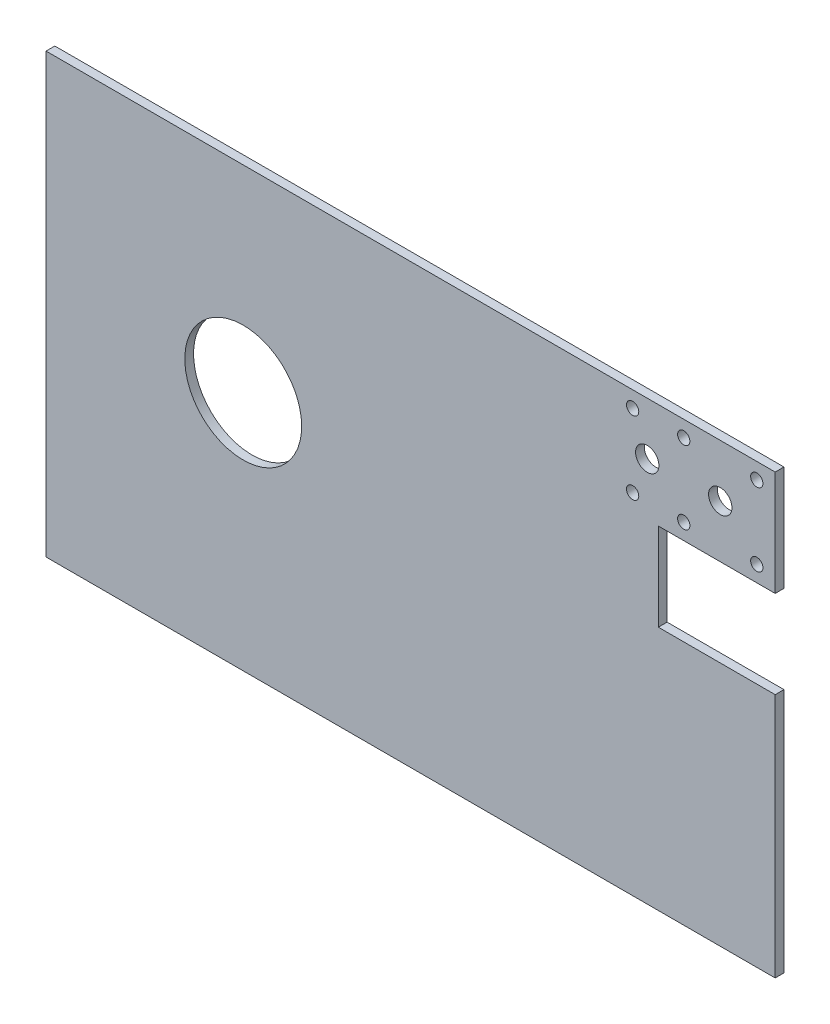
ISO-10303-21;
HEADER;
FILE_DESCRIPTION(('STEP AP214'),'2;1');
FILE_NAME('part.step','',(''),(''),'','','');
FILE_SCHEMA(('AUTOMOTIVE_DESIGN { 1 0 10303 214 1 1 1 1 }'));
ENDSEC;
DATA;
#1=APPLICATION_CONTEXT('core data for automotive mechanical design processes');
#2=APPLICATION_PROTOCOL_DEFINITION('international standard','automotive_design',2000,#1);
#3=PRODUCT_CONTEXT('',#1,'mechanical');
#4=PRODUCT('Part','Part','',(#3));
#5=PRODUCT_RELATED_PRODUCT_CATEGORY('part','',(#4));
#6=PRODUCT_DEFINITION_FORMATION('','',#4);
#7=PRODUCT_DEFINITION_CONTEXT('part definition',#1,'design');
#8=PRODUCT_DEFINITION('design','',#6,#7);
#9=PRODUCT_DEFINITION_SHAPE('','',#8);
#10=(LENGTH_UNIT() NAMED_UNIT(*) SI_UNIT(.MILLI.,.METRE.));
#11=(NAMED_UNIT(*) PLANE_ANGLE_UNIT() SI_UNIT($,.RADIAN.));
#12=(NAMED_UNIT(*) SI_UNIT($,.STERADIAN.) SOLID_ANGLE_UNIT());
#13=UNCERTAINTY_MEASURE_WITH_UNIT(LENGTH_MEASURE(1.E-05),#10,'distance_accuracy_value','');
#14=(GEOMETRIC_REPRESENTATION_CONTEXT(3) GLOBAL_UNCERTAINTY_ASSIGNED_CONTEXT((#13)) GLOBAL_UNIT_ASSIGNED_CONTEXT((#10,
#11,#12)) REPRESENTATION_CONTEXT('',''));
#15=CARTESIAN_POINT('',(0.,0.,0.));
#16=DIRECTION('',(0.,0.,1.));
#17=DIRECTION('',(1.,0.,0.));
#18=AXIS2_PLACEMENT_3D('',#15,#16,#17);
#19=CARTESIAN_POINT('',(249.6,0.,3.));
#20=DIRECTION('',(-1.,0.,0.));
#21=DIRECTION('',(0.,-1.,0.));
#22=AXIS2_PLACEMENT_3D('',#19,#20,#21);
#23=PLANE('',#22);
#24=DIRECTION('',(0.,1.,0.));
#25=VECTOR('',#24,1.);
#26=CARTESIAN_POINT('',(249.6,0.,3.));
#27=LINE('',#26,#25);
#28=CARTESIAN_POINT('',(249.6,-35.9999999999997,3.));
#29=VERTEX_POINT('',#28);
#30=CARTESIAN_POINT('',(249.6,0.,3.));
#31=VERTEX_POINT('',#30);
#32=EDGE_CURVE('E147',#29,#31,#27,.T.);
#33=ORIENTED_EDGE('',*,*,#32,.F.);
#34=DIRECTION('',(0.,0.,1.));
#35=VECTOR('',#34,1.);
#36=CARTESIAN_POINT('',(249.6,-35.9999999999997,-2.));
#37=LINE('',#36,#35);
#38=CARTESIAN_POINT('',(249.6,-35.9999999999997,0.));
#39=VERTEX_POINT('',#38);
#40=EDGE_CURVE('E135',#39,#29,#37,.T.);
#41=ORIENTED_EDGE('',*,*,#40,.F.);
#42=DIRECTION('',(0.,1.,0.));
#43=VECTOR('',#42,1.);
#44=CARTESIAN_POINT('',(249.6,0.,0.));
#45=LINE('',#44,#43);
#46=CARTESIAN_POINT('',(249.6,0.,0.));
#47=VERTEX_POINT('',#46);
#48=EDGE_CURVE('E155',#39,#47,#45,.T.);
#49=ORIENTED_EDGE('',*,*,#48,.T.);
#50=DIRECTION('',(0.,0.,-1.));
#51=VECTOR('',#50,1.);
#52=CARTESIAN_POINT('',(249.6,0.,3.));
#53=LINE('',#52,#51);
#54=EDGE_CURVE('E161',#31,#47,#53,.T.);
#55=ORIENTED_EDGE('',*,*,#54,.F.);
#56=EDGE_LOOP('',(#33,#41,#49,#55));
#57=FACE_BOUND('',#56,.T.);
#58=ADVANCED_FACE('F32',(#57),#23,.F.);
#59=CARTESIAN_POINT('',(0.,0.,3.));
#60=DIRECTION('',(1.,0.,0.));
#61=DIRECTION('',(0.,0.,-1.));
#62=AXIS2_PLACEMENT_3D('',#59,#60,#61);
#63=PLANE('',#62);
#64=DIRECTION('',(0.,-1.,0.));
#65=VECTOR('',#64,1.);
#66=CARTESIAN_POINT('',(0.,0.,0.));
#67=LINE('',#66,#65);
#68=CARTESIAN_POINT('',(0.,0.,0.));
#69=VERTEX_POINT('',#68);
#70=CARTESIAN_POINT('',(0.,-150.,0.));
#71=VERTEX_POINT('',#70);
#72=EDGE_CURVE('E141',#69,#71,#67,.T.);
#73=ORIENTED_EDGE('',*,*,#72,.T.);
#74=DIRECTION('',(0.,0.,-1.));
#75=VECTOR('',#74,1.);
#76=CARTESIAN_POINT('',(0.,-150.,3.));
#77=LINE('',#76,#75);
#78=CARTESIAN_POINT('',(0.,-150.,3.));
#79=VERTEX_POINT('',#78);
#80=EDGE_CURVE('E166',#79,#71,#77,.T.);
#81=ORIENTED_EDGE('',*,*,#80,.F.);
#82=DIRECTION('',(0.,-1.,0.));
#83=VECTOR('',#82,1.);
#84=CARTESIAN_POINT('',(0.,0.,3.));
#85=LINE('',#84,#83);
#86=CARTESIAN_POINT('',(0.,0.,3.));
#87=VERTEX_POINT('',#86);
#88=EDGE_CURVE('E144',#87,#79,#85,.T.);
#89=ORIENTED_EDGE('',*,*,#88,.F.);
#90=DIRECTION('',(0.,0.,-1.));
#91=VECTOR('',#90,1.);
#92=CARTESIAN_POINT('',(0.,0.,3.));
#93=LINE('',#92,#91);
#94=EDGE_CURVE('E150',#87,#69,#93,.T.);
#95=ORIENTED_EDGE('',*,*,#94,.T.);
#96=EDGE_LOOP('',(#73,#81,#89,#95));
#97=FACE_BOUND('',#96,.T.);
#98=ADVANCED_FACE('F34',(#97),#63,.F.);
#99=CARTESIAN_POINT('',(0.,-150.,3.));
#100=DIRECTION('',(0.,1.,0.));
#101=DIRECTION('',(0.,0.,1.));
#102=AXIS2_PLACEMENT_3D('',#99,#100,#101);
#103=PLANE('',#102);
#104=DIRECTION('',(1.,0.,0.));
#105=VECTOR('',#104,1.);
#106=CARTESIAN_POINT('',(0.,-150.,0.));
#107=LINE('',#106,#105);
#108=CARTESIAN_POINT('',(249.6,-150.,0.));
#109=VERTEX_POINT('',#108);
#110=EDGE_CURVE('E153',#71,#109,#107,.T.);
#111=ORIENTED_EDGE('',*,*,#110,.T.);
#112=DIRECTION('',(0.,0.,-1.));
#113=VECTOR('',#112,1.);
#114=CARTESIAN_POINT('',(249.6,-150.,3.));
#115=LINE('',#114,#113);
#116=CARTESIAN_POINT('',(249.6,-150.,3.));
#117=VERTEX_POINT('',#116);
#118=EDGE_CURVE('E163',#117,#109,#115,.T.);
#119=ORIENTED_EDGE('',*,*,#118,.F.);
#120=DIRECTION('',(1.,0.,0.));
#121=VECTOR('',#120,1.);
#122=CARTESIAN_POINT('',(0.,-150.,3.));
#123=LINE('',#122,#121);
#124=EDGE_CURVE('E85',#79,#117,#123,.T.);
#125=ORIENTED_EDGE('',*,*,#124,.F.);
#126=ORIENTED_EDGE('',*,*,#80,.T.);
#127=EDGE_LOOP('',(#111,#119,#125,#126));
#128=FACE_BOUND('',#127,.T.);
#129=ADVANCED_FACE('F183',(#128),#103,.F.);
#130=CARTESIAN_POINT('',(249.6,-65.9999999999997,0.));
#131=VERTEX_POINT('',#130);
#132=EDGE_CURVE('E156',#109,#131,#45,.T.);
#133=ORIENTED_EDGE('',*,*,#132,.T.);
#134=DIRECTION('',(0.,0.,1.));
#135=VECTOR('',#134,1.);
#136=CARTESIAN_POINT('',(249.6,-65.9999999999997,-2.));
#137=LINE('',#136,#135);
#138=CARTESIAN_POINT('',(249.6,-65.9999999999997,3.));
#139=VERTEX_POINT('',#138);
#140=EDGE_CURVE('E47',#131,#139,#137,.T.);
#141=ORIENTED_EDGE('',*,*,#140,.T.);
#142=EDGE_CURVE('E128',#117,#139,#27,.T.);
#143=ORIENTED_EDGE('',*,*,#142,.F.);
#144=ORIENTED_EDGE('',*,*,#118,.T.);
#145=EDGE_LOOP('',(#133,#141,#143,#144));
#146=FACE_BOUND('',#145,.T.);
#147=ADVANCED_FACE('F185',(#146),#23,.F.);
#148=CARTESIAN_POINT('',(0.,0.,3.));
#149=DIRECTION('',(0.,-1.,0.));
#150=DIRECTION('',(0.,0.,-1.));
#151=AXIS2_PLACEMENT_3D('',#148,#149,#150);
#152=PLANE('',#151);
#153=DIRECTION('',(-1.,0.,0.));
#154=VECTOR('',#153,1.);
#155=CARTESIAN_POINT('',(0.,0.,0.));
#156=LINE('',#155,#154);
#157=EDGE_CURVE('E77',#47,#69,#156,.T.);
#158=ORIENTED_EDGE('',*,*,#157,.T.);
#159=ORIENTED_EDGE('',*,*,#94,.F.);
#160=DIRECTION('',(-1.,0.,0.));
#161=VECTOR('',#160,1.);
#162=CARTESIAN_POINT('',(0.,0.,3.));
#163=LINE('',#162,#161);
#164=EDGE_CURVE('E56',#31,#87,#163,.T.);
#165=ORIENTED_EDGE('',*,*,#164,.F.);
#166=ORIENTED_EDGE('',*,*,#54,.T.);
#167=EDGE_LOOP('',(#158,#159,#165,#166));
#168=FACE_BOUND('',#167,.T.);
#169=ADVANCED_FACE('F178',(#168),#152,.F.);
#170=CARTESIAN_POINT('',(0.,0.,3.));
#171=DIRECTION('',(0.,0.,1.));
#172=DIRECTION('',(1.,0.,0.));
#173=AXIS2_PLACEMENT_3D('',#170,#171,#172);
#174=PLANE('',#173);
#175=CARTESIAN_POINT('',(230.799999999998,-17.9999999999998,3.));
#176=DIRECTION('',(0.,0.,1.));
#177=DIRECTION('',(1.,0.,0.));
#178=AXIS2_PLACEMENT_3D('',#175,#176,#177);
#179=CIRCLE('',#178,4.00000000000519);
#180=CARTESIAN_POINT('',(234.800000000003,-17.9999999999998,3.));
#181=VERTEX_POINT('',#180);
#182=EDGE_CURVE('E353',#181,#181,#179,.T.);
#183=ORIENTED_EDGE('',*,*,#182,.F.);
#184=EDGE_LOOP('',(#183));
#185=FACE_BOUND('',#184,.T.);
#186=CARTESIAN_POINT('',(243.299999999998,-30.4999999999998,3.));
#187=DIRECTION('',(0.,0.,1.));
#188=DIRECTION('',(1.,0.,0.));
#189=AXIS2_PLACEMENT_3D('',#186,#187,#188);
#190=CIRCLE('',#189,2.10000000000519);
#191=CARTESIAN_POINT('',(245.400000000003,-30.4999999999998,3.));
#192=VERTEX_POINT('',#191);
#193=EDGE_CURVE('E355',#192,#192,#190,.T.);
#194=ORIENTED_EDGE('',*,*,#193,.F.);
#195=EDGE_LOOP('',(#194));
#196=FACE_BOUND('',#195,.T.);
#197=CARTESIAN_POINT('',(243.299999999998,-5.49999999999979,3.));
#198=DIRECTION('',(0.,0.,1.));
#199=DIRECTION('',(1.,0.,0.));
#200=AXIS2_PLACEMENT_3D('',#197,#198,#199);
#201=CIRCLE('',#200,2.10000000000522);
#202=CARTESIAN_POINT('',(245.400000000003,-5.49999999999979,3.));
#203=VERTEX_POINT('',#202);
#204=EDGE_CURVE('E394',#203,#203,#201,.T.);
#205=ORIENTED_EDGE('',*,*,#204,.F.);
#206=EDGE_LOOP('',(#205));
#207=FACE_BOUND('',#206,.T.);
#208=CARTESIAN_POINT('',(218.299999999998,-30.4999999999998,3.));
#209=DIRECTION('',(0.,0.,1.));
#210=DIRECTION('',(1.,0.,0.));
#211=AXIS2_PLACEMENT_3D('',#208,#209,#210);
#212=CIRCLE('',#211,2.10000000000522);
#213=CARTESIAN_POINT('',(220.400000000003,-30.4999999999998,3.));
#214=VERTEX_POINT('',#213);
#215=EDGE_CURVE('E388',#214,#214,#212,.T.);
#216=ORIENTED_EDGE('',*,*,#215,.F.);
#217=EDGE_LOOP('',(#216));
#218=FACE_BOUND('',#217,.T.);
#219=CARTESIAN_POINT('',(200.799999999998,-30.4999999999997,3.));
#220=DIRECTION('',(0.,0.,1.));
#221=DIRECTION('',(1.,0.,0.));
#222=AXIS2_PLACEMENT_3D('',#219,#220,#221);
#223=CIRCLE('',#222,2.10000000000519);
#224=CARTESIAN_POINT('',(202.900000000003,-30.4999999999997,3.));
#225=VERTEX_POINT('',#224);
#226=EDGE_CURVE('E382',#225,#225,#223,.T.);
#227=ORIENTED_EDGE('',*,*,#226,.F.);
#228=EDGE_LOOP('',(#227));
#229=FACE_BOUND('',#228,.T.);
#230=CARTESIAN_POINT('',(205.799999999996,-18.0000000000112,3.));
#231=DIRECTION('',(0.,0.,1.));
#232=DIRECTION('',(1.,0.,0.));
#233=AXIS2_PLACEMENT_3D('',#230,#231,#232);
#234=CIRCLE('',#233,4.00000000000583);
#235=CARTESIAN_POINT('',(209.800000000001,-18.0000000000112,3.));
#236=VERTEX_POINT('',#235);
#237=EDGE_CURVE('E376',#236,#236,#234,.T.);
#238=ORIENTED_EDGE('',*,*,#237,.F.);
#239=EDGE_LOOP('',(#238));
#240=FACE_BOUND('',#239,.T.);
#241=CARTESIAN_POINT('',(218.299999999998,-5.49999999999974,3.));
#242=DIRECTION('',(0.,0.,1.));
#243=DIRECTION('',(1.,0.,0.));
#244=AXIS2_PLACEMENT_3D('',#241,#242,#243);
#245=CIRCLE('',#244,2.10000000000522);
#246=CARTESIAN_POINT('',(220.400000000003,-5.49999999999974,3.));
#247=VERTEX_POINT('',#246);
#248=EDGE_CURVE('E366',#247,#247,#245,.T.);
#249=ORIENTED_EDGE('',*,*,#248,.F.);
#250=EDGE_LOOP('',(#249));
#251=FACE_BOUND('',#250,.T.);
#252=CARTESIAN_POINT('',(200.799999999998,-5.49999999999971,3.));
#253=DIRECTION('',(0.,0.,1.));
#254=DIRECTION('',(1.,0.,0.));
#255=AXIS2_PLACEMENT_3D('',#252,#253,#254);
#256=CIRCLE('',#255,2.10000000000519);
#257=CARTESIAN_POINT('',(202.900000000003,-5.49999999999971,3.));
#258=VERTEX_POINT('',#257);
#259=EDGE_CURVE('E360',#258,#258,#256,.T.);
#260=ORIENTED_EDGE('',*,*,#259,.F.);
#261=EDGE_LOOP('',(#260));
#262=FACE_BOUND('',#261,.T.);
#263=DIRECTION('',(-1.,0.,0.));
#264=VECTOR('',#263,1.);
#265=CARTESIAN_POINT('',(209.6,-35.9999999999997,3.));
#266=LINE('',#265,#264);
#267=CARTESIAN_POINT('',(209.6,-35.9999999999997,3.));
#268=VERTEX_POINT('',#267);
#269=EDGE_CURVE('E113',#29,#268,#266,.T.);
#270=ORIENTED_EDGE('',*,*,#269,.F.);
#271=ORIENTED_EDGE('',*,*,#32,.T.);
#272=ORIENTED_EDGE('',*,*,#164,.T.);
#273=ORIENTED_EDGE('',*,*,#88,.T.);
#274=ORIENTED_EDGE('',*,*,#124,.T.);
#275=ORIENTED_EDGE('',*,*,#142,.T.);
#276=DIRECTION('',(1.,0.,0.));
#277=VECTOR('',#276,1.);
#278=CARTESIAN_POINT('',(209.6,-65.9999999999997,3.));
#279=LINE('',#278,#277);
#280=CARTESIAN_POINT('',(209.6,-65.9999999999997,3.));
#281=VERTEX_POINT('',#280);
#282=EDGE_CURVE('E109',#281,#139,#279,.T.);
#283=ORIENTED_EDGE('',*,*,#282,.F.);
#284=DIRECTION('',(0.,-1.,0.));
#285=VECTOR('',#284,1.);
#286=CARTESIAN_POINT('',(209.6,-35.9999999999997,3.));
#287=LINE('',#286,#285);
#288=EDGE_CURVE('E116',#268,#281,#287,.T.);
#289=ORIENTED_EDGE('',*,*,#288,.F.);
#290=EDGE_LOOP('',(#270,#271,#272,#273,#274,#275,#283,#289));
#291=FACE_BOUND('',#290,.T.);
#292=CARTESIAN_POINT('',(67.5000000000002,-67.5000000000002,3.));
#293=DIRECTION('',(0.,0.,1.));
#294=DIRECTION('',(1.,0.,0.));
#295=AXIS2_PLACEMENT_3D('',#292,#293,#294);
#296=CIRCLE('',#295,20.);
#297=CARTESIAN_POINT('',(87.5000000000002,-67.5000000000002,3.));
#298=VERTEX_POINT('',#297);
#299=EDGE_CURVE('E134',#298,#298,#296,.T.);
#300=ORIENTED_EDGE('',*,*,#299,.F.);
#301=EDGE_LOOP('',(#300));
#302=FACE_BOUND('',#301,.T.);
#303=ADVANCED_FACE('F125',(#185,#196,#207,#218,#229,#240,#251,#262,#291,#302),#174,.T.);
#304=CARTESIAN_POINT('',(0.,0.,0.));
#305=DIRECTION('',(0.,0.,1.));
#306=DIRECTION('',(1.,0.,0.));
#307=AXIS2_PLACEMENT_3D('',#304,#305,#306);
#308=PLANE('',#307);
#309=CARTESIAN_POINT('',(230.799999999998,-17.9999999999998,0.));
#310=DIRECTION('',(0.,0.,1.));
#311=DIRECTION('',(1.,0.,0.));
#312=AXIS2_PLACEMENT_3D('',#309,#310,#311);
#313=CIRCLE('',#312,4.00000000000519);
#314=CARTESIAN_POINT('',(234.800000000003,-17.9999999999998,0.));
#315=VERTEX_POINT('',#314);
#316=EDGE_CURVE('E350',#315,#315,#313,.T.);
#317=ORIENTED_EDGE('',*,*,#316,.T.);
#318=EDGE_LOOP('',(#317));
#319=FACE_BOUND('',#318,.T.);
#320=CARTESIAN_POINT('',(243.299999999998,-30.4999999999998,0.));
#321=DIRECTION('',(0.,0.,1.));
#322=DIRECTION('',(1.,0.,0.));
#323=AXIS2_PLACEMENT_3D('',#320,#321,#322);
#324=CIRCLE('',#323,2.10000000000519);
#325=CARTESIAN_POINT('',(245.400000000003,-30.4999999999998,0.));
#326=VERTEX_POINT('',#325);
#327=EDGE_CURVE('E397',#326,#326,#324,.T.);
#328=ORIENTED_EDGE('',*,*,#327,.T.);
#329=EDGE_LOOP('',(#328));
#330=FACE_BOUND('',#329,.T.);
#331=CARTESIAN_POINT('',(243.299999999998,-5.49999999999979,0.));
#332=DIRECTION('',(0.,0.,1.));
#333=DIRECTION('',(1.,0.,0.));
#334=AXIS2_PLACEMENT_3D('',#331,#332,#333);
#335=CIRCLE('',#334,2.10000000000522);
#336=CARTESIAN_POINT('',(245.400000000003,-5.49999999999979,0.));
#337=VERTEX_POINT('',#336);
#338=EDGE_CURVE('E391',#337,#337,#335,.T.);
#339=ORIENTED_EDGE('',*,*,#338,.T.);
#340=EDGE_LOOP('',(#339));
#341=FACE_BOUND('',#340,.T.);
#342=CARTESIAN_POINT('',(218.299999999998,-30.4999999999998,0.));
#343=DIRECTION('',(0.,0.,1.));
#344=DIRECTION('',(1.,0.,0.));
#345=AXIS2_PLACEMENT_3D('',#342,#343,#344);
#346=CIRCLE('',#345,2.10000000000522);
#347=CARTESIAN_POINT('',(220.400000000003,-30.4999999999998,0.));
#348=VERTEX_POINT('',#347);
#349=EDGE_CURVE('E385',#348,#348,#346,.T.);
#350=ORIENTED_EDGE('',*,*,#349,.T.);
#351=EDGE_LOOP('',(#350));
#352=FACE_BOUND('',#351,.T.);
#353=CARTESIAN_POINT('',(200.799999999998,-30.4999999999997,0.));
#354=DIRECTION('',(0.,0.,1.));
#355=DIRECTION('',(1.,0.,0.));
#356=AXIS2_PLACEMENT_3D('',#353,#354,#355);
#357=CIRCLE('',#356,2.10000000000519);
#358=CARTESIAN_POINT('',(202.900000000003,-30.4999999999997,0.));
#359=VERTEX_POINT('',#358);
#360=EDGE_CURVE('E379',#359,#359,#357,.T.);
#361=ORIENTED_EDGE('',*,*,#360,.T.);
#362=EDGE_LOOP('',(#361));
#363=FACE_BOUND('',#362,.T.);
#364=CARTESIAN_POINT('',(205.799999999996,-18.0000000000112,0.));
#365=DIRECTION('',(0.,0.,1.));
#366=DIRECTION('',(1.,0.,0.));
#367=AXIS2_PLACEMENT_3D('',#364,#365,#366);
#368=CIRCLE('',#367,4.00000000000583);
#369=CARTESIAN_POINT('',(209.800000000001,-18.0000000000112,0.));
#370=VERTEX_POINT('',#369);
#371=EDGE_CURVE('E371',#370,#370,#368,.T.);
#372=ORIENTED_EDGE('',*,*,#371,.T.);
#373=EDGE_LOOP('',(#372));
#374=FACE_BOUND('',#373,.T.);
#375=CARTESIAN_POINT('',(218.299999999998,-5.49999999999974,0.));
#376=DIRECTION('',(0.,0.,1.));
#377=DIRECTION('',(1.,0.,0.));
#378=AXIS2_PLACEMENT_3D('',#375,#376,#377);
#379=CIRCLE('',#378,2.10000000000522);
#380=CARTESIAN_POINT('',(220.400000000003,-5.49999999999974,0.));
#381=VERTEX_POINT('',#380);
#382=EDGE_CURVE('E362',#381,#381,#379,.T.);
#383=ORIENTED_EDGE('',*,*,#382,.T.);
#384=EDGE_LOOP('',(#383));
#385=FACE_BOUND('',#384,.T.);
#386=CARTESIAN_POINT('',(200.799999999998,-5.49999999999971,0.));
#387=DIRECTION('',(0.,0.,1.));
#388=DIRECTION('',(1.,0.,0.));
#389=AXIS2_PLACEMENT_3D('',#386,#387,#388);
#390=CIRCLE('',#389,2.10000000000519);
#391=CARTESIAN_POINT('',(202.900000000003,-5.49999999999971,0.));
#392=VERTEX_POINT('',#391);
#393=EDGE_CURVE('E122',#392,#392,#390,.T.);
#394=ORIENTED_EDGE('',*,*,#393,.T.);
#395=EDGE_LOOP('',(#394));
#396=FACE_BOUND('',#395,.T.);
#397=CARTESIAN_POINT('',(67.5000000000002,-67.5000000000002,0.));
#398=DIRECTION('',(0.,0.,1.));
#399=DIRECTION('',(1.,0.,0.));
#400=AXIS2_PLACEMENT_3D('',#397,#398,#399);
#401=CIRCLE('',#400,20.);
#402=CARTESIAN_POINT('',(87.5000000000002,-67.5000000000002,0.));
#403=VERTEX_POINT('',#402);
#404=EDGE_CURVE('E138',#403,#403,#401,.T.);
#405=ORIENTED_EDGE('',*,*,#404,.T.);
#406=EDGE_LOOP('',(#405));
#407=FACE_BOUND('',#406,.T.);
#408=ORIENTED_EDGE('',*,*,#48,.F.);
#409=DIRECTION('',(-1.,0.,0.));
#410=VECTOR('',#409,1.);
#411=CARTESIAN_POINT('',(0.,-35.9999999999997,0.));
#412=LINE('',#411,#410);
#413=CARTESIAN_POINT('',(209.6,-35.9999999999997,0.));
#414=VERTEX_POINT('',#413);
#415=EDGE_CURVE('E11',#39,#414,#412,.T.);
#416=ORIENTED_EDGE('',*,*,#415,.T.);
#417=DIRECTION('',(0.,-1.,0.));
#418=VECTOR('',#417,1.);
#419=CARTESIAN_POINT('',(209.6,0.,0.));
#420=LINE('',#419,#418);
#421=CARTESIAN_POINT('',(209.6,-65.9999999999997,0.));
#422=VERTEX_POINT('',#421);
#423=EDGE_CURVE('E40',#414,#422,#420,.T.);
#424=ORIENTED_EDGE('',*,*,#423,.T.);
#425=DIRECTION('',(1.,0.,0.));
#426=VECTOR('',#425,1.);
#427=CARTESIAN_POINT('',(0.,-65.9999999999997,0.));
#428=LINE('',#427,#426);
#429=EDGE_CURVE('E110',#422,#131,#428,.T.);
#430=ORIENTED_EDGE('',*,*,#429,.T.);
#431=ORIENTED_EDGE('',*,*,#132,.F.);
#432=ORIENTED_EDGE('',*,*,#110,.F.);
#433=ORIENTED_EDGE('',*,*,#72,.F.);
#434=ORIENTED_EDGE('',*,*,#157,.F.);
#435=EDGE_LOOP('',(#408,#416,#424,#430,#431,#432,#433,#434));
#436=FACE_BOUND('',#435,.T.);
#437=ADVANCED_FACE('F170',(#319,#330,#341,#352,#363,#374,#385,#396,#407,#436),#308,.F.);
#438=CARTESIAN_POINT('',(67.5000000000002,-67.5000000000002,0.));
#439=DIRECTION('',(0.,0.,1.));
#440=DIRECTION('',(1.,0.,0.));
#441=AXIS2_PLACEMENT_3D('',#438,#439,#440);
#442=CYLINDRICAL_SURFACE('',#441,20.);
#443=ORIENTED_EDGE('',*,*,#404,.F.);
#444=EDGE_LOOP('',(#443));
#445=FACE_BOUND('',#444,.T.);
#446=ORIENTED_EDGE('',*,*,#299,.T.);
#447=EDGE_LOOP('',(#446));
#448=FACE_BOUND('',#447,.T.);
#449=ADVANCED_FACE('F230',(#445,#448),#442,.F.);
#450=CARTESIAN_POINT('',(209.6,-35.9999999999997,-2.));
#451=DIRECTION('',(-1.,0.,0.));
#452=DIRECTION('',(0.,0.,1.));
#453=AXIS2_PLACEMENT_3D('',#450,#451,#452);
#454=PLANE('',#453);
#455=DIRECTION('',(0.,0.,1.));
#456=VECTOR('',#455,1.);
#457=CARTESIAN_POINT('',(209.6,-35.9999999999997,-2.));
#458=LINE('',#457,#456);
#459=EDGE_CURVE('E119',#414,#268,#458,.T.);
#460=ORIENTED_EDGE('',*,*,#459,.T.);
#461=ORIENTED_EDGE('',*,*,#288,.T.);
#462=DIRECTION('',(0.,0.,1.));
#463=VECTOR('',#462,1.);
#464=CARTESIAN_POINT('',(209.6,-65.9999999999997,-2.));
#465=LINE('',#464,#463);
#466=EDGE_CURVE('E105',#422,#281,#465,.T.);
#467=ORIENTED_EDGE('',*,*,#466,.F.);
#468=ORIENTED_EDGE('',*,*,#423,.F.);
#469=EDGE_LOOP('',(#460,#461,#467,#468));
#470=FACE_BOUND('',#469,.T.);
#471=ADVANCED_FACE('F117',(#470),#454,.F.);
#472=CARTESIAN_POINT('',(209.6,-35.9999999999997,-2.));
#473=DIRECTION('',(0.,1.,0.));
#474=DIRECTION('',(0.,0.,1.));
#475=AXIS2_PLACEMENT_3D('',#472,#473,#474);
#476=PLANE('',#475);
#477=ORIENTED_EDGE('',*,*,#40,.T.);
#478=ORIENTED_EDGE('',*,*,#269,.T.);
#479=ORIENTED_EDGE('',*,*,#459,.F.);
#480=ORIENTED_EDGE('',*,*,#415,.F.);
#481=EDGE_LOOP('',(#477,#478,#479,#480));
#482=FACE_BOUND('',#481,.T.);
#483=ADVANCED_FACE('F173',(#482),#476,.F.);
#484=CARTESIAN_POINT('',(209.6,-65.9999999999997,-2.));
#485=DIRECTION('',(0.,-1.,0.));
#486=DIRECTION('',(0.,0.,-1.));
#487=AXIS2_PLACEMENT_3D('',#484,#485,#486);
#488=PLANE('',#487);
#489=ORIENTED_EDGE('',*,*,#466,.T.);
#490=ORIENTED_EDGE('',*,*,#282,.T.);
#491=ORIENTED_EDGE('',*,*,#140,.F.);
#492=ORIENTED_EDGE('',*,*,#429,.F.);
#493=EDGE_LOOP('',(#489,#490,#491,#492));
#494=FACE_BOUND('',#493,.T.);
#495=ADVANCED_FACE('F107',(#494),#488,.F.);
#496=CARTESIAN_POINT('',(200.799999999998,-5.49999999999971,0.));
#497=DIRECTION('',(0.,0.,1.));
#498=DIRECTION('',(1.,0.,0.));
#499=AXIS2_PLACEMENT_3D('',#496,#497,#498);
#500=CYLINDRICAL_SURFACE('',#499,2.10000000000519);
#501=ORIENTED_EDGE('',*,*,#393,.F.);
#502=EDGE_LOOP('',(#501));
#503=FACE_BOUND('',#502,.T.);
#504=ORIENTED_EDGE('',*,*,#259,.T.);
#505=EDGE_LOOP('',(#504));
#506=FACE_BOUND('',#505,.T.);
#507=ADVANCED_FACE('F260',(#503,#506),#500,.F.);
#508=CARTESIAN_POINT('',(218.299999999998,-5.49999999999974,0.));
#509=DIRECTION('',(0.,0.,1.));
#510=DIRECTION('',(1.,0.,0.));
#511=AXIS2_PLACEMENT_3D('',#508,#509,#510);
#512=CYLINDRICAL_SURFACE('',#511,2.10000000000522);
#513=ORIENTED_EDGE('',*,*,#382,.F.);
#514=EDGE_LOOP('',(#513));
#515=FACE_BOUND('',#514,.T.);
#516=ORIENTED_EDGE('',*,*,#248,.T.);
#517=EDGE_LOOP('',(#516));
#518=FACE_BOUND('',#517,.T.);
#519=ADVANCED_FACE('F266',(#515,#518),#512,.F.);
#520=CARTESIAN_POINT('',(205.799999999996,-18.0000000000112,0.));
#521=DIRECTION('',(0.,0.,1.));
#522=DIRECTION('',(1.,0.,0.));
#523=AXIS2_PLACEMENT_3D('',#520,#521,#522);
#524=CYLINDRICAL_SURFACE('',#523,4.00000000000583);
#525=ORIENTED_EDGE('',*,*,#371,.F.);
#526=EDGE_LOOP('',(#525));
#527=FACE_BOUND('',#526,.T.);
#528=ORIENTED_EDGE('',*,*,#237,.T.);
#529=EDGE_LOOP('',(#528));
#530=FACE_BOUND('',#529,.T.);
#531=ADVANCED_FACE('F274',(#527,#530),#524,.F.);
#532=CARTESIAN_POINT('',(200.799999999998,-30.4999999999997,0.));
#533=DIRECTION('',(0.,0.,1.));
#534=DIRECTION('',(1.,0.,0.));
#535=AXIS2_PLACEMENT_3D('',#532,#533,#534);
#536=CYLINDRICAL_SURFACE('',#535,2.10000000000519);
#537=ORIENTED_EDGE('',*,*,#360,.F.);
#538=EDGE_LOOP('',(#537));
#539=FACE_BOUND('',#538,.T.);
#540=ORIENTED_EDGE('',*,*,#226,.T.);
#541=EDGE_LOOP('',(#540));
#542=FACE_BOUND('',#541,.T.);
#543=ADVANCED_FACE('F282',(#539,#542),#536,.F.);
#544=CARTESIAN_POINT('',(218.299999999998,-30.4999999999998,0.));
#545=DIRECTION('',(0.,0.,1.));
#546=DIRECTION('',(1.,0.,0.));
#547=AXIS2_PLACEMENT_3D('',#544,#545,#546);
#548=CYLINDRICAL_SURFACE('',#547,2.10000000000522);
#549=ORIENTED_EDGE('',*,*,#349,.F.);
#550=EDGE_LOOP('',(#549));
#551=FACE_BOUND('',#550,.T.);
#552=ORIENTED_EDGE('',*,*,#215,.T.);
#553=EDGE_LOOP('',(#552));
#554=FACE_BOUND('',#553,.T.);
#555=ADVANCED_FACE('F290',(#551,#554),#548,.F.);
#556=CARTESIAN_POINT('',(243.299999999998,-5.49999999999979,0.));
#557=DIRECTION('',(0.,0.,1.));
#558=DIRECTION('',(1.,0.,0.));
#559=AXIS2_PLACEMENT_3D('',#556,#557,#558);
#560=CYLINDRICAL_SURFACE('',#559,2.10000000000522);
#561=ORIENTED_EDGE('',*,*,#338,.F.);
#562=EDGE_LOOP('',(#561));
#563=FACE_BOUND('',#562,.T.);
#564=ORIENTED_EDGE('',*,*,#204,.T.);
#565=EDGE_LOOP('',(#564));
#566=FACE_BOUND('',#565,.T.);
#567=ADVANCED_FACE('F298',(#563,#566),#560,.F.);
#568=CARTESIAN_POINT('',(243.299999999998,-30.4999999999998,0.));
#569=DIRECTION('',(0.,0.,1.));
#570=DIRECTION('',(1.,0.,0.));
#571=AXIS2_PLACEMENT_3D('',#568,#569,#570);
#572=CYLINDRICAL_SURFACE('',#571,2.10000000000519);
#573=ORIENTED_EDGE('',*,*,#327,.F.);
#574=EDGE_LOOP('',(#573));
#575=FACE_BOUND('',#574,.T.);
#576=ORIENTED_EDGE('',*,*,#193,.T.);
#577=EDGE_LOOP('',(#576));
#578=FACE_BOUND('',#577,.T.);
#579=ADVANCED_FACE('F306',(#575,#578),#572,.F.);
#580=CARTESIAN_POINT('',(230.799999999998,-17.9999999999998,0.));
#581=DIRECTION('',(0.,0.,1.));
#582=DIRECTION('',(1.,0.,0.));
#583=AXIS2_PLACEMENT_3D('',#580,#581,#582);
#584=CYLINDRICAL_SURFACE('',#583,4.00000000000519);
#585=ORIENTED_EDGE('',*,*,#316,.F.);
#586=EDGE_LOOP('',(#585));
#587=FACE_BOUND('',#586,.T.);
#588=ORIENTED_EDGE('',*,*,#182,.T.);
#589=EDGE_LOOP('',(#588));
#590=FACE_BOUND('',#589,.T.);
#591=ADVANCED_FACE('F314',(#587,#590),#584,.F.);
#592=CLOSED_SHELL('',(#58,#98,#129,#147,#169,#303,#437,#449,#471,#483,#495,#507,#519,#531,#543,
#555,#567,#579,#591));
#593=MANIFOLD_SOLID_BREP('B2',#592);
#594=ADVANCED_BREP_SHAPE_REPRESENTATION('',(#18,#593),#14);
#595=SHAPE_DEFINITION_REPRESENTATION(#9,#594);
ENDSEC;
END-ISO-10303-21;
